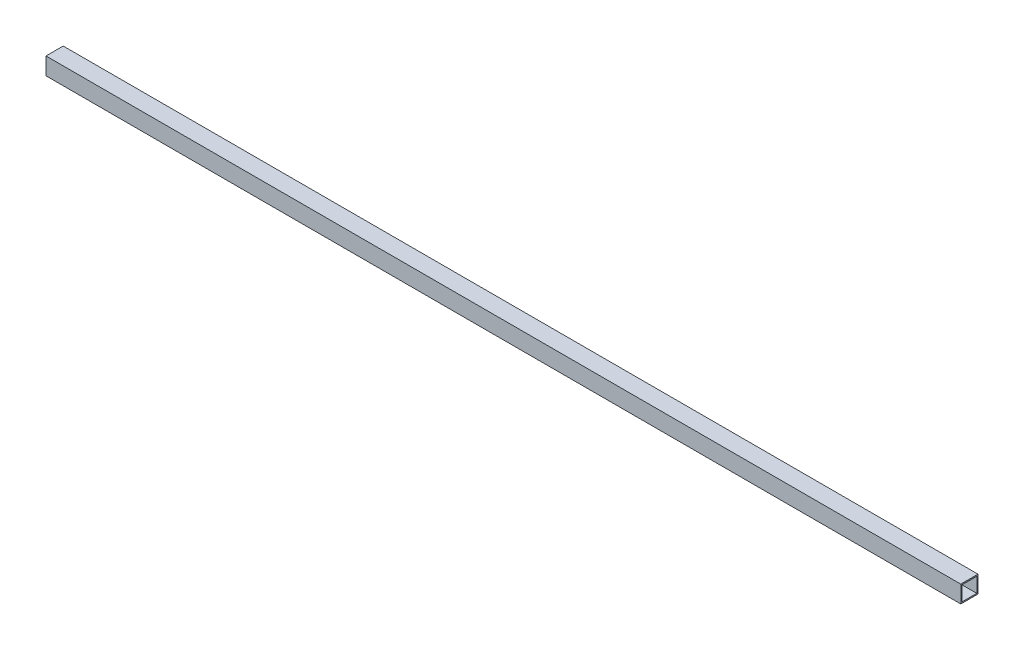
ISO-10303-21;
HEADER;
FILE_DESCRIPTION(('STEP AP214'),'2;1');
FILE_NAME('part.step','',(''),(''),'','','');
FILE_SCHEMA(('AUTOMOTIVE_DESIGN { 1 0 10303 214 1 1 1 1 }'));
ENDSEC;
DATA;
#1=APPLICATION_CONTEXT('core data for automotive mechanical design processes');
#2=APPLICATION_PROTOCOL_DEFINITION('international standard','automotive_design',2000,#1);
#3=PRODUCT_CONTEXT('',#1,'mechanical');
#4=PRODUCT('Part','Part','',(#3));
#5=PRODUCT_RELATED_PRODUCT_CATEGORY('part','',(#4));
#6=PRODUCT_DEFINITION_FORMATION('','',#4);
#7=PRODUCT_DEFINITION_CONTEXT('part definition',#1,'design');
#8=PRODUCT_DEFINITION('design','',#6,#7);
#9=PRODUCT_DEFINITION_SHAPE('','',#8);
#10=(LENGTH_UNIT() NAMED_UNIT(*) SI_UNIT(.MILLI.,.METRE.));
#11=(NAMED_UNIT(*) PLANE_ANGLE_UNIT() SI_UNIT($,.RADIAN.));
#12=(NAMED_UNIT(*) SI_UNIT($,.STERADIAN.) SOLID_ANGLE_UNIT());
#13=UNCERTAINTY_MEASURE_WITH_UNIT(LENGTH_MEASURE(1.E-05),#10,'distance_accuracy_value','');
#14=(GEOMETRIC_REPRESENTATION_CONTEXT(3) GLOBAL_UNCERTAINTY_ASSIGNED_CONTEXT((#13)) GLOBAL_UNIT_ASSIGNED_CONTEXT((#10,
#11,#12)) REPRESENTATION_CONTEXT('',''));
#15=CARTESIAN_POINT('',(0.,0.,0.));
#16=DIRECTION('',(0.,0.,1.));
#17=DIRECTION('',(1.,0.,0.));
#18=AXIS2_PLACEMENT_3D('',#15,#16,#17);
#19=CARTESIAN_POINT('',(0.,0.,44.4499999999999));
#20=DIRECTION('',(1.,0.,0.));
#21=DIRECTION('',(0.,0.,-1.));
#22=AXIS2_PLACEMENT_3D('',#19,#20,#21);
#23=PLANE('',#22);
#24=DIRECTION('',(0.,-1.,0.));
#25=VECTOR('',#24,1.);
#26=CARTESIAN_POINT('',(0.,0.,0.));
#27=LINE('',#26,#25);
#28=CARTESIAN_POINT('',(0.,44.4500000000001,0.));
#29=VERTEX_POINT('',#28);
#30=CARTESIAN_POINT('',(0.,0.,0.));
#31=VERTEX_POINT('',#30);
#32=EDGE_CURVE('E126',#29,#31,#27,.T.);
#33=ORIENTED_EDGE('',*,*,#32,.T.);
#34=DIRECTION('',(0.,0.,-1.));
#35=VECTOR('',#34,1.);
#36=CARTESIAN_POINT('',(0.,0.,44.4499999999999));
#37=LINE('',#36,#35);
#38=CARTESIAN_POINT('',(0.,0.,44.4499999999999));
#39=VERTEX_POINT('',#38);
#40=EDGE_CURVE('E11',#39,#31,#37,.T.);
#41=ORIENTED_EDGE('',*,*,#40,.F.);
#42=DIRECTION('',(0.,-1.,0.));
#43=VECTOR('',#42,1.);
#44=CARTESIAN_POINT('',(0.,0.,44.4499999999999));
#45=LINE('',#44,#43);
#46=CARTESIAN_POINT('',(0.,44.4500000000001,44.4499999999999));
#47=VERTEX_POINT('',#46);
#48=EDGE_CURVE('E131',#47,#39,#45,.T.);
#49=ORIENTED_EDGE('',*,*,#48,.F.);
#50=DIRECTION('',(0.,0.,-1.));
#51=VECTOR('',#50,1.);
#52=CARTESIAN_POINT('',(0.,44.4500000000001,44.4499999999999));
#53=LINE('',#52,#51);
#54=EDGE_CURVE('E141',#47,#29,#53,.T.);
#55=ORIENTED_EDGE('',*,*,#54,.T.);
#56=EDGE_LOOP('',(#33,#41,#49,#55));
#57=FACE_BOUND('',#56,.T.);
#58=DIRECTION('',(0.,-1.,0.));
#59=VECTOR('',#58,1.);
#60=CARTESIAN_POINT('',(0.,0.,3.17500000000015));
#61=LINE('',#60,#59);
#62=CARTESIAN_POINT('',(0.,41.2749999999999,3.17500000000015));
#63=VERTEX_POINT('',#62);
#64=CARTESIAN_POINT('',(0.,3.17499999999993,3.17500000000015));
#65=VERTEX_POINT('',#64);
#66=EDGE_CURVE('E102',#63,#65,#61,.T.);
#67=ORIENTED_EDGE('',*,*,#66,.F.);
#68=DIRECTION('',(0.,0.,-1.));
#69=VECTOR('',#68,1.);
#70=CARTESIAN_POINT('',(0.,41.2749999999999,44.4499999999999));
#71=LINE('',#70,#69);
#72=CARTESIAN_POINT('',(0.,41.2749999999999,41.2750000000002));
#73=VERTEX_POINT('',#72);
#74=EDGE_CURVE('E122',#73,#63,#71,.T.);
#75=ORIENTED_EDGE('',*,*,#74,.F.);
#76=DIRECTION('',(0.,-1.,0.));
#77=VECTOR('',#76,1.);
#78=CARTESIAN_POINT('',(0.,0.,41.2750000000002));
#79=LINE('',#78,#77);
#80=CARTESIAN_POINT('',(0.,3.17499999999993,41.2750000000002));
#81=VERTEX_POINT('',#80);
#82=EDGE_CURVE('E46',#73,#81,#79,.T.);
#83=ORIENTED_EDGE('',*,*,#82,.T.);
#84=DIRECTION('',(0.,0.,-1.));
#85=VECTOR('',#84,1.);
#86=CARTESIAN_POINT('',(0.,3.17499999999993,44.4499999999999));
#87=LINE('',#86,#85);
#88=EDGE_CURVE('E112',#81,#65,#87,.T.);
#89=ORIENTED_EDGE('',*,*,#88,.T.);
#90=EDGE_LOOP('',(#67,#75,#83,#89));
#91=FACE_BOUND('',#90,.T.);
#92=ADVANCED_FACE('F32',(#57,#91),#23,.F.);
#93=CARTESIAN_POINT('',(2360.422,0.,44.4499999999999));
#94=DIRECTION('',(-1.,0.,0.));
#95=DIRECTION('',(0.,0.,1.));
#96=AXIS2_PLACEMENT_3D('',#93,#94,#95);
#97=PLANE('',#96);
#98=DIRECTION('',(0.,1.,0.));
#99=VECTOR('',#98,1.);
#100=CARTESIAN_POINT('',(2360.422,0.,0.));
#101=LINE('',#100,#99);
#102=CARTESIAN_POINT('',(2360.422,0.,0.));
#103=VERTEX_POINT('',#102);
#104=CARTESIAN_POINT('',(2360.422,44.4500000000001,0.));
#105=VERTEX_POINT('',#104);
#106=EDGE_CURVE('E146',#103,#105,#101,.T.);
#107=ORIENTED_EDGE('',*,*,#106,.T.);
#108=DIRECTION('',(0.,0.,-1.));
#109=VECTOR('',#108,1.);
#110=CARTESIAN_POINT('',(2360.422,44.4500000000001,44.4499999999999));
#111=LINE('',#110,#109);
#112=CARTESIAN_POINT('',(2360.422,44.4500000000001,44.4499999999999));
#113=VERTEX_POINT('',#112);
#114=EDGE_CURVE('E151',#113,#105,#111,.T.);
#115=ORIENTED_EDGE('',*,*,#114,.F.);
#116=DIRECTION('',(0.,1.,0.));
#117=VECTOR('',#116,1.);
#118=CARTESIAN_POINT('',(2360.422,0.,44.4499999999999));
#119=LINE('',#118,#117);
#120=CARTESIAN_POINT('',(2360.422,0.,44.4499999999999));
#121=VERTEX_POINT('',#120);
#122=EDGE_CURVE('E137',#121,#113,#119,.T.);
#123=ORIENTED_EDGE('',*,*,#122,.F.);
#124=DIRECTION('',(0.,0.,-1.));
#125=VECTOR('',#124,1.);
#126=CARTESIAN_POINT('',(2360.422,0.,44.4499999999999));
#127=LINE('',#126,#125);
#128=EDGE_CURVE('E39',#121,#103,#127,.T.);
#129=ORIENTED_EDGE('',*,*,#128,.T.);
#130=EDGE_LOOP('',(#107,#115,#123,#129));
#131=FACE_BOUND('',#130,.T.);
#132=DIRECTION('',(0.,1.,0.));
#133=VECTOR('',#132,1.);
#134=CARTESIAN_POINT('',(2360.422,0.,3.17500000000015));
#135=LINE('',#134,#133);
#136=CARTESIAN_POINT('',(2360.422,3.17499999999993,3.17500000000015));
#137=VERTEX_POINT('',#136);
#138=CARTESIAN_POINT('',(2360.422,41.2749999999999,3.17500000000015));
#139=VERTEX_POINT('',#138);
#140=EDGE_CURVE('E99',#137,#139,#135,.T.);
#141=ORIENTED_EDGE('',*,*,#140,.F.);
#142=DIRECTION('',(0.,0.,-1.));
#143=VECTOR('',#142,1.);
#144=CARTESIAN_POINT('',(2360.422,3.17499999999993,44.4499999999999));
#145=LINE('',#144,#143);
#146=CARTESIAN_POINT('',(2360.422,3.17499999999993,41.2750000000002));
#147=VERTEX_POINT('',#146);
#148=EDGE_CURVE('E108',#147,#137,#145,.T.);
#149=ORIENTED_EDGE('',*,*,#148,.F.);
#150=DIRECTION('',(0.,1.,0.));
#151=VECTOR('',#150,1.);
#152=CARTESIAN_POINT('',(2360.422,0.,41.2750000000002));
#153=LINE('',#152,#151);
#154=CARTESIAN_POINT('',(2360.422,41.2749999999999,41.2750000000002));
#155=VERTEX_POINT('',#154);
#156=EDGE_CURVE('E51',#147,#155,#153,.T.);
#157=ORIENTED_EDGE('',*,*,#156,.T.);
#158=DIRECTION('',(0.,0.,-1.));
#159=VECTOR('',#158,1.);
#160=CARTESIAN_POINT('',(2360.422,41.2749999999999,44.4499999999999));
#161=LINE('',#160,#159);
#162=EDGE_CURVE('E113',#155,#139,#161,.T.);
#163=ORIENTED_EDGE('',*,*,#162,.T.);
#164=EDGE_LOOP('',(#141,#149,#157,#163));
#165=FACE_BOUND('',#164,.T.);
#166=ADVANCED_FACE('F116',(#131,#165),#97,.F.);
#167=CARTESIAN_POINT('',(0.,0.,44.4499999999999));
#168=DIRECTION('',(0.,1.,0.));
#169=DIRECTION('',(0.,0.,1.));
#170=AXIS2_PLACEMENT_3D('',#167,#168,#169);
#171=PLANE('',#170);
#172=DIRECTION('',(1.,0.,0.));
#173=VECTOR('',#172,1.);
#174=CARTESIAN_POINT('',(0.,0.,0.));
#175=LINE('',#174,#173);
#176=EDGE_CURVE('E144',#31,#103,#175,.T.);
#177=ORIENTED_EDGE('',*,*,#176,.T.);
#178=ORIENTED_EDGE('',*,*,#128,.F.);
#179=DIRECTION('',(1.,0.,0.));
#180=VECTOR('',#179,1.);
#181=CARTESIAN_POINT('',(0.,0.,44.4499999999999));
#182=LINE('',#181,#180);
#183=EDGE_CURVE('E134',#39,#121,#182,.T.);
#184=ORIENTED_EDGE('',*,*,#183,.F.);
#185=ORIENTED_EDGE('',*,*,#40,.T.);
#186=EDGE_LOOP('',(#177,#178,#184,#185));
#187=FACE_BOUND('',#186,.T.);
#188=ADVANCED_FACE('F174',(#187),#171,.F.);
#189=CARTESIAN_POINT('',(0.,44.4500000000001,44.4499999999999));
#190=DIRECTION('',(0.,-1.,0.));
#191=DIRECTION('',(0.,0.,-1.));
#192=AXIS2_PLACEMENT_3D('',#189,#190,#191);
#193=PLANE('',#192);
#194=DIRECTION('',(-1.,0.,0.));
#195=VECTOR('',#194,1.);
#196=CARTESIAN_POINT('',(0.,44.4500000000001,0.));
#197=LINE('',#196,#195);
#198=EDGE_CURVE('E135',#105,#29,#197,.T.);
#199=ORIENTED_EDGE('',*,*,#198,.T.);
#200=ORIENTED_EDGE('',*,*,#54,.F.);
#201=DIRECTION('',(-1.,0.,0.));
#202=VECTOR('',#201,1.);
#203=CARTESIAN_POINT('',(0.,44.4500000000001,44.4499999999999));
#204=LINE('',#203,#202);
#205=EDGE_CURVE('E139',#113,#47,#204,.T.);
#206=ORIENTED_EDGE('',*,*,#205,.F.);
#207=ORIENTED_EDGE('',*,*,#114,.T.);
#208=EDGE_LOOP('',(#199,#200,#206,#207));
#209=FACE_BOUND('',#208,.T.);
#210=ADVANCED_FACE('F166',(#209),#193,.F.);
#211=CARTESIAN_POINT('',(0.,0.,44.4499999999999));
#212=DIRECTION('',(0.,0.,-1.));
#213=DIRECTION('',(-1.,0.,0.));
#214=AXIS2_PLACEMENT_3D('',#211,#212,#213);
#215=PLANE('',#214);
#216=ORIENTED_EDGE('',*,*,#48,.T.);
#217=ORIENTED_EDGE('',*,*,#183,.T.);
#218=ORIENTED_EDGE('',*,*,#122,.T.);
#219=ORIENTED_EDGE('',*,*,#205,.T.);
#220=EDGE_LOOP('',(#216,#217,#218,#219));
#221=FACE_BOUND('',#220,.T.);
#222=ADVANCED_FACE('F173',(#221),#215,.F.);
#223=CARTESIAN_POINT('',(0.,0.,0.));
#224=DIRECTION('',(0.,0.,-1.));
#225=DIRECTION('',(-1.,0.,0.));
#226=AXIS2_PLACEMENT_3D('',#223,#224,#225);
#227=PLANE('',#226);
#228=ORIENTED_EDGE('',*,*,#32,.F.);
#229=ORIENTED_EDGE('',*,*,#198,.F.);
#230=ORIENTED_EDGE('',*,*,#106,.F.);
#231=ORIENTED_EDGE('',*,*,#176,.F.);
#232=EDGE_LOOP('',(#228,#229,#230,#231));
#233=FACE_BOUND('',#232,.T.);
#234=ADVANCED_FACE('F163',(#233),#227,.T.);
#235=CARTESIAN_POINT('',(0.,3.17499999999993,44.4499999999999));
#236=DIRECTION('',(0.,1.,0.));
#237=DIRECTION('',(0.,0.,1.));
#238=AXIS2_PLACEMENT_3D('',#235,#236,#237);
#239=PLANE('',#238);
#240=DIRECTION('',(1.,0.,0.));
#241=VECTOR('',#240,1.);
#242=CARTESIAN_POINT('',(0.,3.17499999999993,3.17500000000015));
#243=LINE('',#242,#241);
#244=EDGE_CURVE('E95',#65,#137,#243,.T.);
#245=ORIENTED_EDGE('',*,*,#244,.F.);
#246=ORIENTED_EDGE('',*,*,#88,.F.);
#247=DIRECTION('',(1.,0.,0.));
#248=VECTOR('',#247,1.);
#249=CARTESIAN_POINT('',(0.,3.17499999999993,41.2750000000002));
#250=LINE('',#249,#248);
#251=EDGE_CURVE('E110',#81,#147,#250,.T.);
#252=ORIENTED_EDGE('',*,*,#251,.T.);
#253=ORIENTED_EDGE('',*,*,#148,.T.);
#254=EDGE_LOOP('',(#245,#246,#252,#253));
#255=FACE_BOUND('',#254,.T.);
#256=ADVANCED_FACE('F109',(#255),#239,.T.);
#257=CARTESIAN_POINT('',(0.,41.2749999999999,44.4499999999999));
#258=DIRECTION('',(0.,-1.,0.));
#259=DIRECTION('',(0.,0.,-1.));
#260=AXIS2_PLACEMENT_3D('',#257,#258,#259);
#261=PLANE('',#260);
#262=DIRECTION('',(-1.,0.,0.));
#263=VECTOR('',#262,1.);
#264=CARTESIAN_POINT('',(0.,41.2749999999999,3.17500000000015));
#265=LINE('',#264,#263);
#266=EDGE_CURVE('E117',#139,#63,#265,.T.);
#267=ORIENTED_EDGE('',*,*,#266,.F.);
#268=ORIENTED_EDGE('',*,*,#162,.F.);
#269=DIRECTION('',(-1.,0.,0.));
#270=VECTOR('',#269,1.);
#271=CARTESIAN_POINT('',(0.,41.2749999999999,41.2750000000002));
#272=LINE('',#271,#270);
#273=EDGE_CURVE('E124',#155,#73,#272,.T.);
#274=ORIENTED_EDGE('',*,*,#273,.T.);
#275=ORIENTED_EDGE('',*,*,#74,.T.);
#276=EDGE_LOOP('',(#267,#268,#274,#275));
#277=FACE_BOUND('',#276,.T.);
#278=ADVANCED_FACE('F224',(#277),#261,.T.);
#279=CARTESIAN_POINT('',(0.,0.,41.2750000000002));
#280=DIRECTION('',(0.,0.,-1.));
#281=DIRECTION('',(-1.,0.,0.));
#282=AXIS2_PLACEMENT_3D('',#279,#280,#281);
#283=PLANE('',#282);
#284=ORIENTED_EDGE('',*,*,#82,.F.);
#285=ORIENTED_EDGE('',*,*,#273,.F.);
#286=ORIENTED_EDGE('',*,*,#156,.F.);
#287=ORIENTED_EDGE('',*,*,#251,.F.);
#288=EDGE_LOOP('',(#284,#285,#286,#287));
#289=FACE_BOUND('',#288,.T.);
#290=ADVANCED_FACE('F233',(#289),#283,.T.);
#291=CARTESIAN_POINT('',(0.,0.,3.17500000000015));
#292=DIRECTION('',(0.,0.,-1.));
#293=DIRECTION('',(-1.,0.,0.));
#294=AXIS2_PLACEMENT_3D('',#291,#292,#293);
#295=PLANE('',#294);
#296=ORIENTED_EDGE('',*,*,#66,.T.);
#297=ORIENTED_EDGE('',*,*,#244,.T.);
#298=ORIENTED_EDGE('',*,*,#140,.T.);
#299=ORIENTED_EDGE('',*,*,#266,.T.);
#300=EDGE_LOOP('',(#296,#297,#298,#299));
#301=FACE_BOUND('',#300,.T.);
#302=ADVANCED_FACE('F97',(#301),#295,.F.);
#303=CLOSED_SHELL('',(#92,#166,#188,#210,#222,#234,#256,#278,#290,#302));
#304=MANIFOLD_SOLID_BREP('B2',#303);
#305=ADVANCED_BREP_SHAPE_REPRESENTATION('',(#18,#304),#14);
#306=SHAPE_DEFINITION_REPRESENTATION(#9,#305);
ENDSEC;
END-ISO-10303-21;
